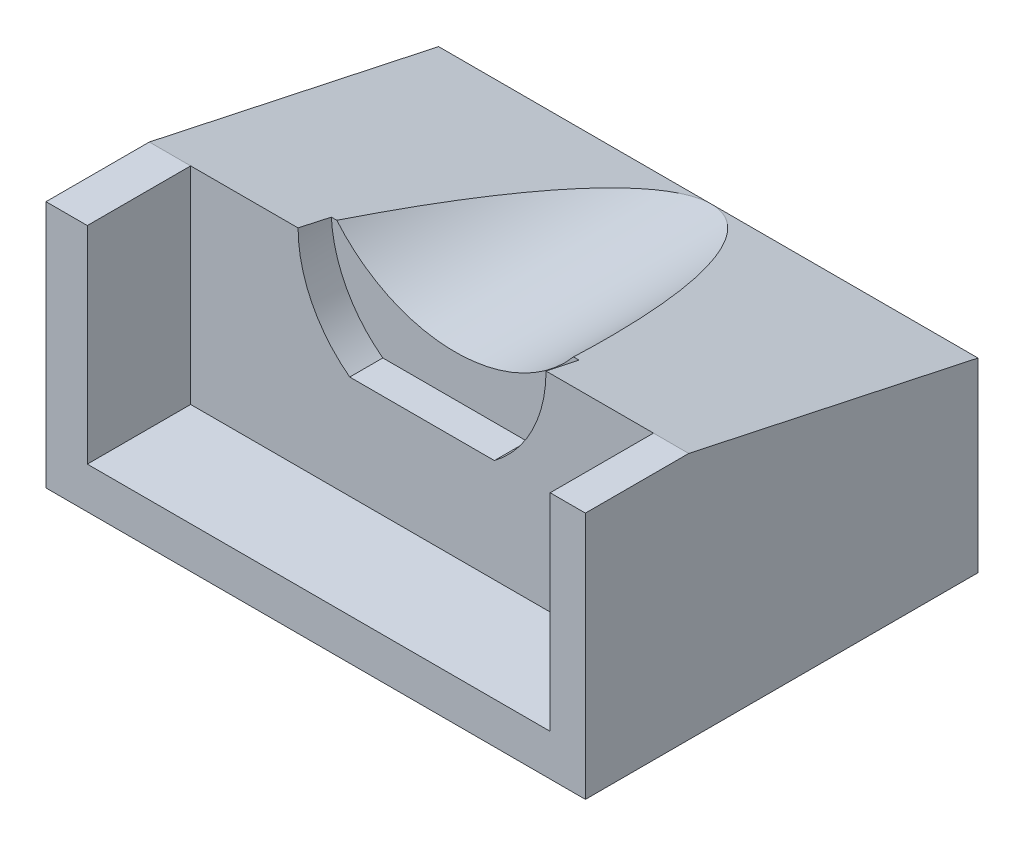
ISO-10303-21;
HEADER;
FILE_DESCRIPTION(('STEP AP214'),'2;1');
FILE_NAME('part.step','',(''),(''),'','','');
FILE_SCHEMA(('AUTOMOTIVE_DESIGN { 1 0 10303 214 1 1 1 1 }'));
ENDSEC;
DATA;
#1=APPLICATION_CONTEXT('core data for automotive mechanical design processes');
#2=APPLICATION_PROTOCOL_DEFINITION('international standard','automotive_design',2000,#1);
#3=PRODUCT_CONTEXT('',#1,'mechanical');
#4=PRODUCT('Part','Part','',(#3));
#5=PRODUCT_RELATED_PRODUCT_CATEGORY('part','',(#4));
#6=PRODUCT_DEFINITION_FORMATION('','',#4);
#7=PRODUCT_DEFINITION_CONTEXT('part definition',#1,'design');
#8=PRODUCT_DEFINITION('design','',#6,#7);
#9=PRODUCT_DEFINITION_SHAPE('','',#8);
#10=(LENGTH_UNIT() NAMED_UNIT(*) SI_UNIT(.MILLI.,.METRE.));
#11=(NAMED_UNIT(*) PLANE_ANGLE_UNIT() SI_UNIT($,.RADIAN.));
#12=(NAMED_UNIT(*) SI_UNIT($,.STERADIAN.) SOLID_ANGLE_UNIT());
#13=UNCERTAINTY_MEASURE_WITH_UNIT(LENGTH_MEASURE(1.E-05),#10,'distance_accuracy_value','');
#14=(GEOMETRIC_REPRESENTATION_CONTEXT(3) GLOBAL_UNCERTAINTY_ASSIGNED_CONTEXT((#13)) GLOBAL_UNIT_ASSIGNED_CONTEXT((#10,
#11,#12)) REPRESENTATION_CONTEXT('',''));
#15=CARTESIAN_POINT('',(0.,0.,0.));
#16=DIRECTION('',(0.,0.,1.));
#17=DIRECTION('',(1.,0.,0.));
#18=AXIS2_PLACEMENT_3D('',#15,#16,#17);
#19=CARTESIAN_POINT('',(-11.2,5.,14.));
#20=DIRECTION('',(0.,-1.,0.));
#21=DIRECTION('',(0.,0.,-1.));
#22=AXIS2_PLACEMENT_3D('',#19,#20,#21);
#23=PLANE('',#22);
#24=DIRECTION('',(0.,0.,-1.));
#25=VECTOR('',#24,1.);
#26=CARTESIAN_POINT('',(12.9053814835629,5.,52.731358171906));
#27=LINE('',#26,#25);
#28=CARTESIAN_POINT('',(12.9053814835629,5.,19.));
#29=VERTEX_POINT('',#28);
#30=CARTESIAN_POINT('',(12.9053814835629,5.,14.));
#31=VERTEX_POINT('',#30);
#32=EDGE_CURVE('E161',#29,#31,#27,.T.);
#33=ORIENTED_EDGE('',*,*,#32,.T.);
#34=DIRECTION('',(-1.,0.,0.));
#35=VECTOR('',#34,1.);
#36=CARTESIAN_POINT('',(12.9053814835629,5.,14.));
#37=LINE('',#36,#35);
#38=CARTESIAN_POINT('',(11.2,5.,14.));
#39=VERTEX_POINT('',#38);
#40=EDGE_CURVE('E50',#31,#39,#37,.T.);
#41=ORIENTED_EDGE('',*,*,#40,.T.);
#42=DIRECTION('',(0.,0.,-1.));
#43=VECTOR('',#42,1.);
#44=CARTESIAN_POINT('',(11.2,5.,52.731358171906));
#45=LINE('',#44,#43);
#46=CARTESIAN_POINT('',(11.2,5.,19.));
#47=VERTEX_POINT('',#46);
#48=EDGE_CURVE('E163',#47,#39,#45,.T.);
#49=ORIENTED_EDGE('',*,*,#48,.F.);
#50=DIRECTION('',(-1.,0.,0.));
#51=VECTOR('',#50,1.);
#52=CARTESIAN_POINT('',(12.9053814835629,5.,19.));
#53=LINE('',#52,#51);
#54=EDGE_CURVE('E180',#29,#47,#53,.T.);
#55=ORIENTED_EDGE('',*,*,#54,.F.);
#56=EDGE_LOOP('',(#33,#41,#49,#55));
#57=FACE_BOUND('',#56,.T.);
#58=ADVANCED_FACE('F35',(#57),#23,.F.);
#59=DIRECTION('',(0.,0.,-1.));
#60=VECTOR('',#59,1.);
#61=CARTESIAN_POINT('',(-11.2,5.,52.731358171906));
#62=LINE('',#61,#60);
#63=CARTESIAN_POINT('',(-11.2,5.,19.));
#64=VERTEX_POINT('',#63);
#65=CARTESIAN_POINT('',(-11.2,5.,14.));
#66=VERTEX_POINT('',#65);
#67=EDGE_CURVE('E202',#64,#66,#62,.T.);
#68=ORIENTED_EDGE('',*,*,#67,.T.);
#69=CARTESIAN_POINT('',(-13.2,5.,14.));
#70=VERTEX_POINT('',#69);
#71=EDGE_CURVE('E155',#66,#70,#37,.T.);
#72=ORIENTED_EDGE('',*,*,#71,.T.);
#73=DIRECTION('',(0.,0.,-1.));
#74=VECTOR('',#73,1.);
#75=CARTESIAN_POINT('',(-13.2,5.,52.731358171906));
#76=LINE('',#75,#74);
#77=CARTESIAN_POINT('',(-13.2,5.,19.));
#78=VERTEX_POINT('',#77);
#79=EDGE_CURVE('E175',#78,#70,#76,.T.);
#80=ORIENTED_EDGE('',*,*,#79,.F.);
#81=DIRECTION('',(-1.,0.,0.));
#82=VECTOR('',#81,1.);
#83=CARTESIAN_POINT('',(-11.2,5.,19.));
#84=LINE('',#83,#82);
#85=EDGE_CURVE('E192',#64,#78,#84,.T.);
#86=ORIENTED_EDGE('',*,*,#85,.F.);
#87=EDGE_LOOP('',(#68,#72,#80,#86));
#88=FACE_BOUND('',#87,.T.);
#89=ADVANCED_FACE('F37',(#88),#23,.F.);
#90=CARTESIAN_POINT('',(0.,0.,14.));
#91=DIRECTION('',(0.,0.,1.));
#92=DIRECTION('',(1.,0.,0.));
#93=AXIS2_PLACEMENT_3D('',#90,#91,#92);
#94=PLANE('',#93);
#95=CARTESIAN_POINT('',(-0.24999999999999,5.,14.));
#96=DIRECTION('',(0.,0.,1.));
#97=DIRECTION('',(-1.,0.,0.));
#98=AXIS2_PLACEMENT_3D('',#95,#96,#97);
#99=CIRCLE('',#98,6.24999999999999);
#100=CARTESIAN_POINT('',(3.5,0.,14.));
#101=VERTEX_POINT('',#100);
#102=CARTESIAN_POINT('',(6.,5.,14.));
#103=VERTEX_POINT('',#102);
#104=EDGE_CURVE('E218',#101,#103,#99,.T.);
#105=ORIENTED_EDGE('',*,*,#104,.F.);
#106=DIRECTION('',(1.,0.,0.));
#107=VECTOR('',#106,1.);
#108=CARTESIAN_POINT('',(-3.5,0.,14.));
#109=LINE('',#108,#107);
#110=CARTESIAN_POINT('',(-3.5,0.,14.));
#111=VERTEX_POINT('',#110);
#112=EDGE_CURVE('E223',#111,#101,#109,.T.);
#113=ORIENTED_EDGE('',*,*,#112,.F.);
#114=CARTESIAN_POINT('',(0.249999999999983,5.,14.));
#115=DIRECTION('',(0.,0.,1.));
#116=DIRECTION('',(1.,0.,0.));
#117=AXIS2_PLACEMENT_3D('',#114,#115,#116);
#118=CIRCLE('',#117,6.24999999999999);
#119=CARTESIAN_POINT('',(-6.,5.,14.));
#120=VERTEX_POINT('',#119);
#121=EDGE_CURVE('E231',#120,#111,#118,.T.);
#122=ORIENTED_EDGE('',*,*,#121,.F.);
#123=DIRECTION('',(-1.,0.,0.));
#124=VECTOR('',#123,1.);
#125=CARTESIAN_POINT('',(-11.2,5.,14.));
#126=LINE('',#125,#124);
#127=EDGE_CURVE('E241',#120,#66,#126,.T.);
#128=ORIENTED_EDGE('',*,*,#127,.T.);
#129=DIRECTION('',(0.,-1.,0.));
#130=VECTOR('',#129,1.);
#131=CARTESIAN_POINT('',(-11.2,5.,14.));
#132=LINE('',#131,#130);
#133=CARTESIAN_POINT('',(-11.2,-5.,14.));
#134=VERTEX_POINT('',#133);
#135=EDGE_CURVE('E43',#66,#134,#132,.T.);
#136=ORIENTED_EDGE('',*,*,#135,.T.);
#137=DIRECTION('',(1.,0.,0.));
#138=VECTOR('',#137,1.);
#139=CARTESIAN_POINT('',(-11.2,-5.,14.));
#140=LINE('',#139,#138);
#141=CARTESIAN_POINT('',(11.2,-5.,14.));
#142=VERTEX_POINT('',#141);
#143=EDGE_CURVE('E12',#134,#142,#140,.T.);
#144=ORIENTED_EDGE('',*,*,#143,.T.);
#145=DIRECTION('',(0.,1.,0.));
#146=VECTOR('',#145,1.);
#147=CARTESIAN_POINT('',(11.2,5.,14.));
#148=LINE('',#147,#146);
#149=EDGE_CURVE('E238',#142,#39,#148,.T.);
#150=ORIENTED_EDGE('',*,*,#149,.T.);
#151=EDGE_CURVE('E242',#39,#103,#126,.T.);
#152=ORIENTED_EDGE('',*,*,#151,.T.);
#153=EDGE_LOOP('',(#105,#113,#122,#128,#136,#144,#150,#152));
#154=FACE_BOUND('',#153,.T.);
#155=ADVANCED_FACE('F247',(#154),#94,.T.);
#156=CARTESIAN_POINT('',(0.,0.,0.));
#157=DIRECTION('',(0.,0.,1.));
#158=DIRECTION('',(1.,0.,0.));
#159=AXIS2_PLACEMENT_3D('',#156,#157,#158);
#160=PLANE('',#159);
#161=DIRECTION('',(0.,-1.,0.));
#162=VECTOR('',#161,1.);
#163=CARTESIAN_POINT('',(-13.2,5.,0.));
#164=LINE('',#163,#162);
#165=CARTESIAN_POINT('',(-13.2,2.,0.));
#166=VERTEX_POINT('',#165);
#167=CARTESIAN_POINT('',(-13.2,-7.00000000000001,0.));
#168=VERTEX_POINT('',#167);
#169=EDGE_CURVE('E173',#166,#168,#164,.T.);
#170=ORIENTED_EDGE('',*,*,#169,.F.);
#171=DIRECTION('',(-1.,0.,0.));
#172=VECTOR('',#171,1.);
#173=CARTESIAN_POINT('',(12.9053814835629,2.,0.));
#174=LINE('',#173,#172);
#175=CARTESIAN_POINT('',(0.,2.,0.));
#176=VERTEX_POINT('',#175);
#177=EDGE_CURVE('E145',#176,#166,#174,.T.);
#178=ORIENTED_EDGE('',*,*,#177,.F.);
#179=CARTESIAN_POINT('',(12.9053814835629,2.,0.));
#180=VERTEX_POINT('',#179);
#181=EDGE_CURVE('E139',#180,#176,#174,.T.);
#182=ORIENTED_EDGE('',*,*,#181,.F.);
#183=DIRECTION('',(0.,1.,0.));
#184=VECTOR('',#183,1.);
#185=CARTESIAN_POINT('',(12.9053814835629,-7.,0.));
#186=LINE('',#185,#184);
#187=CARTESIAN_POINT('',(12.9053814835629,-7.,0.));
#188=VERTEX_POINT('',#187);
#189=EDGE_CURVE('E153',#188,#180,#186,.T.);
#190=ORIENTED_EDGE('',*,*,#189,.F.);
#191=DIRECTION('',(1.,0.,0.));
#192=VECTOR('',#191,1.);
#193=CARTESIAN_POINT('',(-13.2,-7.00000000000001,0.));
#194=LINE('',#193,#192);
#195=EDGE_CURVE('E165',#168,#188,#194,.T.);
#196=ORIENTED_EDGE('',*,*,#195,.F.);
#197=EDGE_LOOP('',(#170,#178,#182,#190,#196));
#198=FACE_BOUND('',#197,.T.);
#199=ADVANCED_FACE('F151',(#198),#160,.F.);
#200=CARTESIAN_POINT('',(-0.24999999999999,5.,12.4));
#201=DIRECTION('',(0.,0.,1.));
#202=DIRECTION('',(1.,0.,0.));
#203=AXIS2_PLACEMENT_3D('',#200,#201,#202);
#204=CYLINDRICAL_SURFACE('',#203,6.24999999999999);
#205=ORIENTED_EDGE('',*,*,#104,.T.);
#206=CARTESIAN_POINT('',(-0.24999999999999,5.,14.));
#207=DIRECTION('',(0.,-0.977802414077409,0.209529088730874));
#208=DIRECTION('',(0.,0.209529088730874,0.97780241407741));
#209=AXIS2_PLACEMENT_3D('',#206,#207,#208);
#210=ELLIPSE('',#209,29.8287938818257,6.24999999999999);
#211=CARTESIAN_POINT('',(5.99058883276184,4.65714285714286,12.4));
#212=VERTEX_POINT('',#211);
#213=EDGE_CURVE('E169',#103,#212,#210,.F.);
#214=ORIENTED_EDGE('',*,*,#213,.T.);
#215=CARTESIAN_POINT('',(-0.24999999999999,5.,12.4));
#216=DIRECTION('',(0.,0.,1.));
#217=DIRECTION('',(-1.,0.,0.));
#218=AXIS2_PLACEMENT_3D('',#215,#216,#217);
#219=CIRCLE('',#218,6.24999999999999);
#220=CARTESIAN_POINT('',(3.5,0.,12.4));
#221=VERTEX_POINT('',#220);
#222=EDGE_CURVE('E219',#221,#212,#219,.T.);
#223=ORIENTED_EDGE('',*,*,#222,.F.);
#224=DIRECTION('',(0.,0.,1.));
#225=VECTOR('',#224,1.);
#226=CARTESIAN_POINT('',(3.5,0.,12.4));
#227=LINE('',#226,#225);
#228=EDGE_CURVE('E236',#221,#101,#227,.T.);
#229=ORIENTED_EDGE('',*,*,#228,.T.);
#230=EDGE_LOOP('',(#205,#214,#223,#229));
#231=FACE_BOUND('',#230,.T.);
#232=ADVANCED_FACE('F271',(#231),#204,.F.);
#233=CARTESIAN_POINT('',(-3.5,0.,12.4));
#234=DIRECTION('',(0.,-1.,0.));
#235=DIRECTION('',(1.,0.,0.));
#236=AXIS2_PLACEMENT_3D('',#233,#234,#235);
#237=PLANE('',#236);
#238=ORIENTED_EDGE('',*,*,#112,.T.);
#239=ORIENTED_EDGE('',*,*,#228,.F.);
#240=DIRECTION('',(1.,0.,0.));
#241=VECTOR('',#240,1.);
#242=CARTESIAN_POINT('',(-3.5,0.,12.4));
#243=LINE('',#242,#241);
#244=CARTESIAN_POINT('',(-3.5,0.,12.4));
#245=VERTEX_POINT('',#244);
#246=EDGE_CURVE('E225',#245,#221,#243,.T.);
#247=ORIENTED_EDGE('',*,*,#246,.F.);
#248=DIRECTION('',(0.,0.,1.));
#249=VECTOR('',#248,1.);
#250=CARTESIAN_POINT('',(-3.5,0.,12.4));
#251=LINE('',#250,#249);
#252=EDGE_CURVE('E228',#245,#111,#251,.T.);
#253=ORIENTED_EDGE('',*,*,#252,.T.);
#254=EDGE_LOOP('',(#238,#239,#247,#253));
#255=FACE_BOUND('',#254,.T.);
#256=ADVANCED_FACE('F274',(#255),#237,.F.);
#257=CARTESIAN_POINT('',(0.249999999999983,5.,12.4));
#258=DIRECTION('',(0.,0.,1.));
#259=DIRECTION('',(1.,0.,0.));
#260=AXIS2_PLACEMENT_3D('',#257,#258,#259);
#261=CYLINDRICAL_SURFACE('',#260,6.24999999999999);
#262=CARTESIAN_POINT('',(0.249999999999983,5.,12.4));
#263=DIRECTION('',(0.,0.,1.));
#264=DIRECTION('',(1.,0.,0.));
#265=AXIS2_PLACEMENT_3D('',#262,#263,#264);
#266=CIRCLE('',#265,6.24999999999999);
#267=CARTESIAN_POINT('',(-5.99058883276185,4.65714285714286,12.4));
#268=VERTEX_POINT('',#267);
#269=EDGE_CURVE('E222',#268,#245,#266,.T.);
#270=ORIENTED_EDGE('',*,*,#269,.F.);
#271=CARTESIAN_POINT('',(0.249999999999983,5.,14.));
#272=DIRECTION('',(0.,-0.977802414077409,0.209529088730874));
#273=DIRECTION('',(0.,0.209529088730874,0.97780241407741));
#274=AXIS2_PLACEMENT_3D('',#271,#272,#273);
#275=ELLIPSE('',#274,29.8287938818257,6.24999999999999);
#276=EDGE_CURVE('E270',#268,#120,#275,.F.);
#277=ORIENTED_EDGE('',*,*,#276,.T.);
#278=ORIENTED_EDGE('',*,*,#121,.T.);
#279=ORIENTED_EDGE('',*,*,#252,.F.);
#280=EDGE_LOOP('',(#270,#277,#278,#279));
#281=FACE_BOUND('',#280,.T.);
#282=ADVANCED_FACE('F279',(#281),#261,.F.);
#283=CARTESIAN_POINT('',(-0.24999999999999,5.,12.4));
#284=DIRECTION('',(0.,0.,-1.));
#285=DIRECTION('',(-1.,0.,0.));
#286=AXIS2_PLACEMENT_3D('',#283,#284,#285);
#287=PLANE('',#286);
#288=ORIENTED_EDGE('',*,*,#222,.T.);
#289=DIRECTION('',(-1.,0.,0.));
#290=VECTOR('',#289,1.);
#291=CARTESIAN_POINT('',(-0.24999999999999,4.65714285714286,12.4));
#292=LINE('',#291,#290);
#293=CARTESIAN_POINT('',(5.72684334462517,4.65714285714286,12.4));
#294=VERTEX_POINT('',#293);
#295=EDGE_CURVE('E267',#212,#294,#292,.T.);
#296=ORIENTED_EDGE('',*,*,#295,.T.);
#297=CARTESIAN_POINT('',(0.,9.50000000000002,12.4));
#298=DIRECTION('',(0.,0.,1.));
#299=DIRECTION('',(1.,0.,0.));
#300=AXIS2_PLACEMENT_3D('',#297,#298,#299);
#301=CIRCLE('',#300,7.50000000000001);
#302=CARTESIAN_POINT('',(-5.72684334462518,4.65714285714286,12.4));
#303=VERTEX_POINT('',#302);
#304=EDGE_CURVE('E179',#303,#294,#301,.T.);
#305=ORIENTED_EDGE('',*,*,#304,.F.);
#306=EDGE_CURVE('E282',#303,#268,#292,.T.);
#307=ORIENTED_EDGE('',*,*,#306,.T.);
#308=ORIENTED_EDGE('',*,*,#269,.T.);
#309=ORIENTED_EDGE('',*,*,#246,.T.);
#310=EDGE_LOOP('',(#288,#296,#305,#307,#308,#309));
#311=FACE_BOUND('',#310,.T.);
#312=ADVANCED_FACE('F325',(#311),#287,.F.);
#313=CARTESIAN_POINT('',(0.,9.50000000000002,0.));
#314=DIRECTION('',(0.,0.,1.));
#315=DIRECTION('',(1.,0.,0.));
#316=AXIS2_PLACEMENT_3D('',#313,#314,#315);
#317=CYLINDRICAL_SURFACE('',#316,7.50000000000001);
#318=ORIENTED_EDGE('',*,*,#304,.T.);
#319=CARTESIAN_POINT('',(0.,9.50000000000002,35.));
#320=DIRECTION('',(0.,-0.977802414077409,0.209529088730874));
#321=DIRECTION('',(0.,0.209529088730874,0.97780241407741));
#322=AXIS2_PLACEMENT_3D('',#319,#320,#321);
#323=ELLIPSE('',#322,35.7945526581909,7.50000000000001);
#324=EDGE_CURVE('E285',#294,#176,#323,.F.);
#325=ORIENTED_EDGE('',*,*,#324,.T.);
#326=EDGE_CURVE('E262',#176,#303,#323,.F.);
#327=ORIENTED_EDGE('',*,*,#326,.T.);
#328=EDGE_LOOP('',(#318,#325,#327));
#329=FACE_BOUND('',#328,.T.);
#330=ADVANCED_FACE('F330',(#329),#317,.F.);
#331=CARTESIAN_POINT('',(-11.2,-5.,52.731358171906));
#332=DIRECTION('',(-1.,0.,0.));
#333=DIRECTION('',(0.,0.,1.));
#334=AXIS2_PLACEMENT_3D('',#331,#332,#333);
#335=PLANE('',#334);
#336=ORIENTED_EDGE('',*,*,#135,.F.);
#337=ORIENTED_EDGE('',*,*,#67,.F.);
#338=DIRECTION('',(0.,1.,0.));
#339=VECTOR('',#338,1.);
#340=CARTESIAN_POINT('',(-11.2,-5.,19.));
#341=LINE('',#340,#339);
#342=CARTESIAN_POINT('',(-11.2,-5.,19.));
#343=VERTEX_POINT('',#342);
#344=EDGE_CURVE('E195',#343,#64,#341,.T.);
#345=ORIENTED_EDGE('',*,*,#344,.F.);
#346=DIRECTION('',(0.,0.,-1.));
#347=VECTOR('',#346,1.);
#348=CARTESIAN_POINT('',(-11.2,-5.,52.731358171906));
#349=LINE('',#348,#347);
#350=EDGE_CURVE('E205',#343,#134,#349,.T.);
#351=ORIENTED_EDGE('',*,*,#350,.T.);
#352=EDGE_LOOP('',(#336,#337,#345,#351));
#353=FACE_BOUND('',#352,.T.);
#354=ADVANCED_FACE('F255',(#353),#335,.F.);
#355=CARTESIAN_POINT('',(-13.2,5.,52.731358171906));
#356=DIRECTION('',(1.,0.,0.));
#357=DIRECTION('',(0.,1.,0.));
#358=AXIS2_PLACEMENT_3D('',#355,#356,#357);
#359=PLANE('',#358);
#360=ORIENTED_EDGE('',*,*,#79,.T.);
#361=DIRECTION('',(0.,0.209529088730874,0.977802414077409));
#362=VECTOR('',#361,1.);
#363=CARTESIAN_POINT('',(-13.2,5.,14.));
#364=LINE('',#363,#362);
#365=EDGE_CURVE('E146',#166,#70,#364,.T.);
#366=ORIENTED_EDGE('',*,*,#365,.F.);
#367=ORIENTED_EDGE('',*,*,#169,.T.);
#368=DIRECTION('',(0.,0.,-1.));
#369=VECTOR('',#368,1.);
#370=CARTESIAN_POINT('',(-13.2,-7.00000000000001,52.731358171906));
#371=LINE('',#370,#369);
#372=CARTESIAN_POINT('',(-13.2,-7.00000000000001,19.));
#373=VERTEX_POINT('',#372);
#374=EDGE_CURVE('E172',#373,#168,#371,.T.);
#375=ORIENTED_EDGE('',*,*,#374,.F.);
#376=DIRECTION('',(0.,-1.,0.));
#377=VECTOR('',#376,1.);
#378=CARTESIAN_POINT('',(-13.2,5.,19.));
#379=LINE('',#378,#377);
#380=EDGE_CURVE('E189',#78,#373,#379,.T.);
#381=ORIENTED_EDGE('',*,*,#380,.F.);
#382=EDGE_LOOP('',(#360,#366,#367,#375,#381));
#383=FACE_BOUND('',#382,.T.);
#384=ADVANCED_FACE('F294',(#383),#359,.F.);
#385=CARTESIAN_POINT('',(-13.2,-7.00000000000001,52.731358171906));
#386=DIRECTION('',(0.,1.,0.));
#387=DIRECTION('',(-1.,0.,0.));
#388=AXIS2_PLACEMENT_3D('',#385,#386,#387);
#389=PLANE('',#388);
#390=DIRECTION('',(1.,0.,0.));
#391=VECTOR('',#390,1.);
#392=CARTESIAN_POINT('',(-13.2,-7.00000000000001,19.));
#393=LINE('',#392,#391);
#394=CARTESIAN_POINT('',(12.9053814835629,-7.,19.));
#395=VERTEX_POINT('',#394);
#396=EDGE_CURVE('E186',#373,#395,#393,.T.);
#397=ORIENTED_EDGE('',*,*,#396,.F.);
#398=ORIENTED_EDGE('',*,*,#374,.T.);
#399=ORIENTED_EDGE('',*,*,#195,.T.);
#400=DIRECTION('',(0.,0.,-1.));
#401=VECTOR('',#400,1.);
#402=CARTESIAN_POINT('',(12.9053814835629,-7.,52.731358171906));
#403=LINE('',#402,#401);
#404=EDGE_CURVE('E159',#395,#188,#403,.T.);
#405=ORIENTED_EDGE('',*,*,#404,.F.);
#406=EDGE_LOOP('',(#397,#398,#399,#405));
#407=FACE_BOUND('',#406,.T.);
#408=ADVANCED_FACE('F297',(#407),#389,.F.);
#409=CARTESIAN_POINT('',(12.9053814835629,-7.,52.731358171906));
#410=DIRECTION('',(-1.,0.,0.));
#411=DIRECTION('',(0.,0.,1.));
#412=AXIS2_PLACEMENT_3D('',#409,#410,#411);
#413=PLANE('',#412);
#414=ORIENTED_EDGE('',*,*,#189,.T.);
#415=DIRECTION('',(0.,0.209529088730874,0.977802414077409));
#416=VECTOR('',#415,1.);
#417=CARTESIAN_POINT('',(12.9053814835629,5.,14.));
#418=LINE('',#417,#416);
#419=EDGE_CURVE('E136',#180,#31,#418,.T.);
#420=ORIENTED_EDGE('',*,*,#419,.T.);
#421=ORIENTED_EDGE('',*,*,#32,.F.);
#422=DIRECTION('',(0.,1.,0.));
#423=VECTOR('',#422,1.);
#424=CARTESIAN_POINT('',(12.9053814835629,-7.,19.));
#425=LINE('',#424,#423);
#426=EDGE_CURVE('E183',#395,#29,#425,.T.);
#427=ORIENTED_EDGE('',*,*,#426,.F.);
#428=ORIENTED_EDGE('',*,*,#404,.T.);
#429=EDGE_LOOP('',(#414,#420,#421,#427,#428));
#430=FACE_BOUND('',#429,.T.);
#431=ADVANCED_FACE('F157',(#430),#413,.F.);
#432=CARTESIAN_POINT('',(11.2,5.,52.731358171906));
#433=DIRECTION('',(1.,0.,0.));
#434=DIRECTION('',(0.,1.,0.));
#435=AXIS2_PLACEMENT_3D('',#432,#433,#434);
#436=PLANE('',#435);
#437=ORIENTED_EDGE('',*,*,#149,.F.);
#438=DIRECTION('',(0.,0.,-1.));
#439=VECTOR('',#438,1.);
#440=CARTESIAN_POINT('',(11.2,-5.,52.731358171906));
#441=LINE('',#440,#439);
#442=CARTESIAN_POINT('',(11.2,-5.,19.));
#443=VERTEX_POINT('',#442);
#444=EDGE_CURVE('E201',#443,#142,#441,.T.);
#445=ORIENTED_EDGE('',*,*,#444,.F.);
#446=DIRECTION('',(0.,-1.,0.));
#447=VECTOR('',#446,1.);
#448=CARTESIAN_POINT('',(11.2,5.,19.));
#449=LINE('',#448,#447);
#450=EDGE_CURVE('E176',#47,#443,#449,.T.);
#451=ORIENTED_EDGE('',*,*,#450,.F.);
#452=ORIENTED_EDGE('',*,*,#48,.T.);
#453=EDGE_LOOP('',(#437,#445,#451,#452));
#454=FACE_BOUND('',#453,.T.);
#455=ADVANCED_FACE('F260',(#454),#436,.F.);
#456=CARTESIAN_POINT('',(11.2,-5.,52.731358171906));
#457=DIRECTION('',(0.,-1.,0.));
#458=DIRECTION('',(0.,0.,-1.));
#459=AXIS2_PLACEMENT_3D('',#456,#457,#458);
#460=PLANE('',#459);
#461=ORIENTED_EDGE('',*,*,#143,.F.);
#462=ORIENTED_EDGE('',*,*,#350,.F.);
#463=DIRECTION('',(-1.,0.,0.));
#464=VECTOR('',#463,1.);
#465=CARTESIAN_POINT('',(11.2,-5.,19.));
#466=LINE('',#465,#464);
#467=EDGE_CURVE('E198',#443,#343,#466,.T.);
#468=ORIENTED_EDGE('',*,*,#467,.F.);
#469=ORIENTED_EDGE('',*,*,#444,.T.);
#470=EDGE_LOOP('',(#461,#462,#468,#469));
#471=FACE_BOUND('',#470,.T.);
#472=ADVANCED_FACE('F252',(#471),#460,.F.);
#473=CARTESIAN_POINT('',(0.,0.,19.));
#474=DIRECTION('',(0.,0.,1.));
#475=DIRECTION('',(1.,0.,0.));
#476=AXIS2_PLACEMENT_3D('',#473,#474,#475);
#477=PLANE('',#476);
#478=ORIENTED_EDGE('',*,*,#467,.T.);
#479=ORIENTED_EDGE('',*,*,#344,.T.);
#480=ORIENTED_EDGE('',*,*,#85,.T.);
#481=ORIENTED_EDGE('',*,*,#380,.T.);
#482=ORIENTED_EDGE('',*,*,#396,.T.);
#483=ORIENTED_EDGE('',*,*,#426,.T.);
#484=ORIENTED_EDGE('',*,*,#54,.T.);
#485=ORIENTED_EDGE('',*,*,#450,.T.);
#486=EDGE_LOOP('',(#478,#479,#480,#481,#482,#483,#484,#485));
#487=FACE_BOUND('',#486,.T.);
#488=ADVANCED_FACE('F257',(#487),#477,.T.);
#489=CARTESIAN_POINT('',(12.9053814835629,5.,14.));
#490=DIRECTION('',(0.,-0.977802414077409,0.209529088730874));
#491=DIRECTION('',(0.,-0.209529088730874,-0.97780241407741));
#492=AXIS2_PLACEMENT_3D('',#489,#490,#491);
#493=PLANE('',#492);
#494=ORIENTED_EDGE('',*,*,#151,.F.);
#495=ORIENTED_EDGE('',*,*,#40,.F.);
#496=ORIENTED_EDGE('',*,*,#419,.F.);
#497=ORIENTED_EDGE('',*,*,#181,.T.);
#498=ORIENTED_EDGE('',*,*,#324,.F.);
#499=ORIENTED_EDGE('',*,*,#295,.F.);
#500=ORIENTED_EDGE('',*,*,#213,.F.);
#501=EDGE_LOOP('',(#494,#495,#496,#497,#498,#499,#500));
#502=FACE_BOUND('',#501,.T.);
#503=ADVANCED_FACE('F138',(#502),#493,.F.);
#504=ORIENTED_EDGE('',*,*,#306,.F.);
#505=ORIENTED_EDGE('',*,*,#326,.F.);
#506=ORIENTED_EDGE('',*,*,#177,.T.);
#507=ORIENTED_EDGE('',*,*,#365,.T.);
#508=ORIENTED_EDGE('',*,*,#71,.F.);
#509=ORIENTED_EDGE('',*,*,#127,.F.);
#510=ORIENTED_EDGE('',*,*,#276,.F.);
#511=EDGE_LOOP('',(#504,#505,#506,#507,#508,#509,#510));
#512=FACE_BOUND('',#511,.T.);
#513=ADVANCED_FACE('F290',(#512),#493,.F.);
#514=CLOSED_SHELL('',(#58,#89,#155,#199,#232,#256,#282,#312,#330,#354,#384,#408,#431,#455,#472,
#488,#503,#513));
#515=MANIFOLD_SOLID_BREP('B2',#514);
#516=ADVANCED_BREP_SHAPE_REPRESENTATION('',(#18,#515),#14);
#517=SHAPE_DEFINITION_REPRESENTATION(#9,#516);
ENDSEC;
END-ISO-10303-21;
